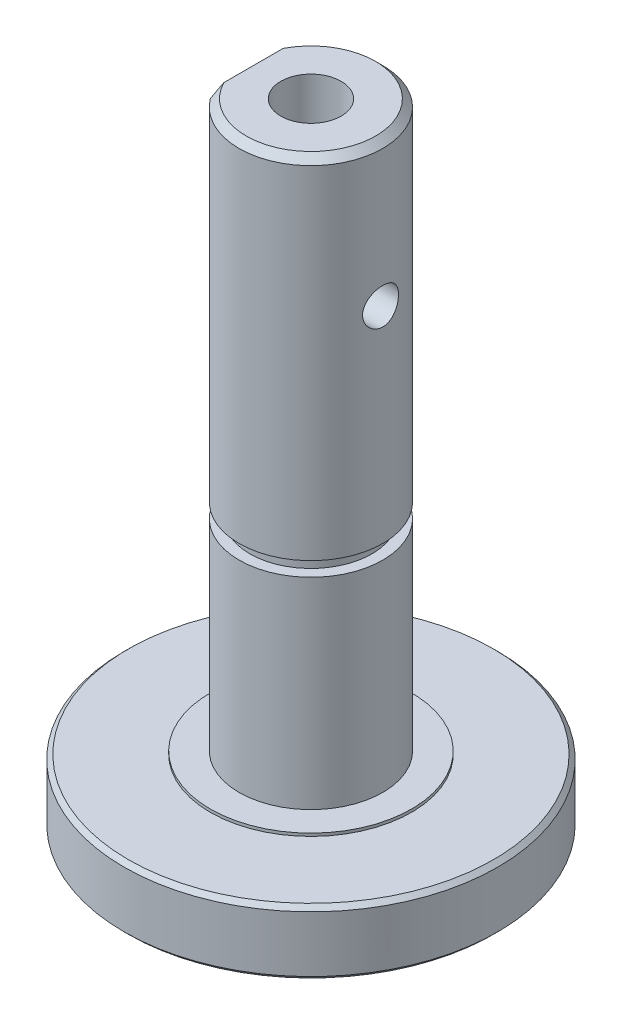
ISO-10303-21;
HEADER;
FILE_DESCRIPTION(('STEP AP214'),'2;1');
FILE_NAME('part.step','',(''),(''),'','','');
FILE_SCHEMA(('AUTOMOTIVE_DESIGN { 1 0 10303 214 1 1 1 1 }'));
ENDSEC;
DATA;
#1=APPLICATION_CONTEXT('core data for automotive mechanical design processes');
#2=APPLICATION_PROTOCOL_DEFINITION('international standard','automotive_design',2000,#1);
#3=PRODUCT_CONTEXT('',#1,'mechanical');
#4=PRODUCT('Part','Part','',(#3));
#5=PRODUCT_RELATED_PRODUCT_CATEGORY('part','',(#4));
#6=PRODUCT_DEFINITION_FORMATION('','',#4);
#7=PRODUCT_DEFINITION_CONTEXT('part definition',#1,'design');
#8=PRODUCT_DEFINITION('design','',#6,#7);
#9=PRODUCT_DEFINITION_SHAPE('','',#8);
#10=(LENGTH_UNIT() NAMED_UNIT(*) SI_UNIT(.MILLI.,.METRE.));
#11=(NAMED_UNIT(*) PLANE_ANGLE_UNIT() SI_UNIT($,.RADIAN.));
#12=(NAMED_UNIT(*) SI_UNIT($,.STERADIAN.) SOLID_ANGLE_UNIT());
#13=UNCERTAINTY_MEASURE_WITH_UNIT(LENGTH_MEASURE(1.E-05),#10,'distance_accuracy_value','');
#14=(GEOMETRIC_REPRESENTATION_CONTEXT(3) GLOBAL_UNCERTAINTY_ASSIGNED_CONTEXT((#13)) GLOBAL_UNIT_ASSIGNED_CONTEXT((#10,
#11,#12)) REPRESENTATION_CONTEXT('',''));
#15=CARTESIAN_POINT('',(0.,0.,0.));
#16=DIRECTION('',(0.,0.,1.));
#17=DIRECTION('',(1.,0.,0.));
#18=AXIS2_PLACEMENT_3D('',#15,#16,#17);
#19=CARTESIAN_POINT('',(0.,29.9999999999727,0.));
#20=DIRECTION('',(0.,1.,0.));
#21=DIRECTION('',(0.,0.,1.));
#22=AXIS2_PLACEMENT_3D('',#19,#20,#21);
#23=CONICAL_SURFACE('',#22,2.09999999992761,1.02974425863875);
#24=CARTESIAN_POINT('',(0.,28.7381927000183,0.));
#25=VERTEX_POINT('',#24);
#26=VERTEX_LOOP('',#25);
#27=FACE_BOUND('',#26,.T.);
#28=CARTESIAN_POINT('',(0.,30.,0.));
#29=DIRECTION('',(0.,1.,0.));
#30=DIRECTION('',(0.,0.,1.));
#31=AXIS2_PLACEMENT_3D('',#28,#29,#30);
#32=CIRCLE('',#31,2.09999999999999);
#33=CARTESIAN_POINT('',(0.,30.,2.09999999999999));
#34=VERTEX_POINT('',#33);
#35=EDGE_CURVE('E89',#34,#34,#32,.T.);
#36=ORIENTED_EDGE('',*,*,#35,.T.);
#37=EDGE_LOOP('',(#36));
#38=FACE_BOUND('',#37,.T.);
#39=ADVANCED_FACE('F16',(#27,#38),#23,.F.);
#40=CARTESIAN_POINT('',(-4.,34.,0.));
#41=DIRECTION('',(-1.,0.,0.));
#42=DIRECTION('',(0.,0.,1.));
#43=AXIS2_PLACEMENT_3D('',#40,#41,#42);
#44=CYLINDRICAL_SURFACE('',#43,1.24999999999999);
#45=CARTESIAN_POINT('',(-1.68745370306862,34.,1.24999999999999));
#46=CARTESIAN_POINT('',(-1.68745610640581,34.0630006655252,1.2499985309283));
#47=CARTESIAN_POINT('',(-1.6910375144996,34.1260114563411,1.24520515796918));
#48=CARTESIAN_POINT('',(-1.70474338519784,34.2499246597574,1.22636763306319));
#49=CARTESIAN_POINT('',(-1.71487580479799,34.3108244133437,1.2123122308622));
#50=CARTESIAN_POINT('',(-1.74005255159893,34.4284522290474,1.17588168193644));
#51=CARTESIAN_POINT('',(-1.75506152675973,34.4852068184474,1.15356625785283));
#52=CARTESIAN_POINT('',(-1.78823762026106,34.5941304009677,1.10143511032645));
#53=CARTESIAN_POINT('',(-1.80640570016159,34.6462979906087,1.07161710202794));
#54=CARTESIAN_POINT('',(-1.84649124284766,34.7514455644668,1.00115022776827));
#55=CARTESIAN_POINT('',(-1.86859693490956,34.803770364812,0.959630581346921));
#56=CARTESIAN_POINT('',(-1.91255564221283,34.9012559706951,0.868725291822874));
#57=CARTESIAN_POINT('',(-1.93440846308017,34.9464115659202,0.819333979649907));
#58=CARTESIAN_POINT('',(-1.97814126615291,35.0329973386529,0.707751404075617));
#59=CARTESIAN_POINT('',(-1.99977989298549,35.0735290197329,0.644758970804779));
#60=CARTESIAN_POINT('',(-2.0379782362367,35.1431104883153,0.511315990956433));
#61=CARTESIAN_POINT('',(-2.05454250560576,35.172170575465,0.440872206891049));
#62=CARTESIAN_POINT('',(-2.07932595217146,35.2150603977896,0.30154302365347));
#63=CARTESIAN_POINT('',(-2.08818464098306,35.2300676903063,0.233136790814246));
#64=CARTESIAN_POINT('',(-2.09903519762539,35.2484015892297,0.0942621280415494));
#65=CARTESIAN_POINT('',(-2.10103339121444,35.2517389560099,0.0237956582692887));
#66=CARTESIAN_POINT('',(-2.09813230663177,35.2468594070678,-0.107922099914165));
#67=CARTESIAN_POINT('',(-2.09404538266851,35.2400034520701,-0.169248065338556));
#68=CARTESIAN_POINT('',(-2.08080479518968,35.2175103337466,-0.289692009797121));
#69=CARTESIAN_POINT('',(-2.07165075831288,35.2018725233442,-0.348809825785033));
#70=CARTESIAN_POINT('',(-2.04899681367323,35.1623898164071,-0.463756346217702));
#71=CARTESIAN_POINT('',(-2.03546963256177,35.1384933479882,-0.519561736907154));
#72=CARTESIAN_POINT('',(-2.00515805145886,35.0833689520189,-0.626443464571555));
#73=CARTESIAN_POINT('',(-1.98837278114531,35.0521390650493,-0.677518532554832));
#74=CARTESIAN_POINT('',(-1.95063183484878,34.9790601269537,-0.77997231991843));
#75=CARTESIAN_POINT('',(-1.92941768288255,34.9363914778028,-0.830670674290609));
#76=CARTESIAN_POINT('',(-1.88620279016148,34.8437657020769,-0.92461859838975));
#77=CARTESIAN_POINT('',(-1.86420103318825,34.7937988827901,-0.967858092785041));
#78=CARTESIAN_POINT('',(-1.81898454674941,34.6812901775024,-1.0505988962443));
#79=CARTESIAN_POINT('',(-1.79591422588884,34.6179651542356,-1.08912374671594));
#80=CARTESIAN_POINT('',(-1.754432628485,34.4842884036896,-1.15476510422905));
#81=CARTESIAN_POINT('',(-1.73601273216002,34.4139500187967,-1.1819027807022));
#82=CARTESIAN_POINT('',(-1.7107125877551,34.2862165675972,-1.21812282599001));
#83=CARTESIAN_POINT('',(-1.70210071456545,34.2299625126262,-1.2300189880835));
#84=CARTESIAN_POINT('',(-1.6904730508573,34.1158073167195,-1.24595420207078));
#85=CARTESIAN_POINT('',(-1.68745149400791,34.0579079355976,-1.25000135031762));
#86=CARTESIAN_POINT('',(-1.68745610640581,33.9369993344748,-1.2499985309283));
#87=CARTESIAN_POINT('',(-1.6910375144996,33.8739885436589,-1.24520515796918));
#88=CARTESIAN_POINT('',(-1.70474338519785,33.7500753402425,-1.22636763306319));
#89=CARTESIAN_POINT('',(-1.71487580479799,33.6891755866563,-1.2123122308622));
#90=CARTESIAN_POINT('',(-1.74005255159893,33.5715477709525,-1.17588168193644));
#91=CARTESIAN_POINT('',(-1.75506152675973,33.5147931815526,-1.15356625785283));
#92=CARTESIAN_POINT('',(-1.78823762026106,33.4058695990322,-1.10143511032645));
#93=CARTESIAN_POINT('',(-1.8064057001616,33.3537020093912,-1.07161710202795));
#94=CARTESIAN_POINT('',(-1.84649124284766,33.2485544355332,-1.00115022776827));
#95=CARTESIAN_POINT('',(-1.86859693490957,33.196229635188,-0.95963058134692));
#96=CARTESIAN_POINT('',(-1.91255564221284,33.0987440293049,-0.868725291822871));
#97=CARTESIAN_POINT('',(-1.93440846308018,33.0535884340798,-0.819333979649906));
#98=CARTESIAN_POINT('',(-1.97814126615291,32.9670026613471,-0.707751404075615));
#99=CARTESIAN_POINT('',(-1.99977989298549,32.9264709802671,-0.644758970804775));
#100=CARTESIAN_POINT('',(-2.0379782362367,32.8568895116847,-0.511315990956426));
#101=CARTESIAN_POINT('',(-2.05454250560577,32.827829424535,-0.440872206891041));
#102=CARTESIAN_POINT('',(-2.07932595217146,32.7849396022104,-0.301543023653461));
#103=CARTESIAN_POINT('',(-2.08818464098306,32.7699323096937,-0.233136790814237));
#104=CARTESIAN_POINT('',(-2.09903519762539,32.7515984107702,-0.0942621280415395));
#105=CARTESIAN_POINT('',(-2.10103339121444,32.7482610439901,-0.0237956582692779));
#106=CARTESIAN_POINT('',(-2.09813230663177,32.7531405929322,0.107922099914177));
#107=CARTESIAN_POINT('',(-2.09404538266851,32.7599965479299,0.169248065338568));
#108=CARTESIAN_POINT('',(-2.08080479518968,32.7824896662534,0.289692009797132));
#109=CARTESIAN_POINT('',(-2.07165075831288,32.7981274766558,0.348809825785042));
#110=CARTESIAN_POINT('',(-2.04899681367323,32.8376101835929,0.463756346217712));
#111=CARTESIAN_POINT('',(-2.03546963256177,32.8615066520118,0.519561736907165));
#112=CARTESIAN_POINT('',(-2.00515805145885,32.9166310479811,0.626443464571564));
#113=CARTESIAN_POINT('',(-1.9883727811453,32.9478609349507,0.677518532554839));
#114=CARTESIAN_POINT('',(-1.95063183484878,33.0209398730463,0.779972319918435));
#115=CARTESIAN_POINT('',(-1.92941768288254,33.0636085221972,0.830670674290614));
#116=CARTESIAN_POINT('',(-1.88620279016147,33.1562342979231,0.924618598389756));
#117=CARTESIAN_POINT('',(-1.86420103318825,33.2062011172099,0.967858092785046));
#118=CARTESIAN_POINT('',(-1.8189845467494,33.3187098224976,1.0505988962443));
#119=CARTESIAN_POINT('',(-1.79591422588884,33.3820348457645,1.08912374671594));
#120=CARTESIAN_POINT('',(-1.75443262848499,33.5157115963104,1.15476510422905));
#121=CARTESIAN_POINT('',(-1.73601273216002,33.5860499812033,1.1819027807022));
#122=CARTESIAN_POINT('',(-1.71071258775509,33.7137834324028,1.21812282599));
#123=CARTESIAN_POINT('',(-1.70210071456545,33.7700374873738,1.23001898808349));
#124=CARTESIAN_POINT('',(-1.6904730508573,33.8841926832804,1.24595420207077));
#125=CARTESIAN_POINT('',(-1.68745149400791,33.9420920644024,1.25000135031761));
#126=CARTESIAN_POINT('',(-1.68745370306862,34.,1.24999999999999));
#127=B_SPLINE_CURVE_WITH_KNOTS('',3,(#45,#46,#47,#48,#49,#50,#51,#52,#53,#54,#55,#56,#57,#58,
#59,#60,#61,#62,#63,#64,#65,#66,#67,#68,#69,#70,#71,#72,#73,#74,#75,#76,#77,#78,#79,#80,#81,#82,
#83,#84,#85,#86,#87,#88,#89,#90,#91,#92,#93,#94,#95,#96,#97,#98,#99,#100,#101,#102,#103,#104,
#105,#106,#107,#108,#109,#110,#111,#112,#113,#114,#115,#116,#117,#118,#119,#120,#121,#122,#123,
#124,#125,#126),.UNSPECIFIED.,.T.,.F.,(4,2,2,2,2,2,2,2,2,2,2,2,2,2,2,2,2,2,2,2,2,2,2,2,2,2,2,2,
2,2,2,2,2,2,2,2,2,2,2,2,4),(0.,0.188755215617773,0.377740129079827,0.565384493647486,
0.753086073212704,0.963335203118905,1.17373644167763,1.40638056831623,1.63881534024358,
1.84933743265751,2.05966535978179,2.24431346785787,2.42897518321382,2.6148115167868,
2.80069756066443,3.00859753163288,3.21677616877338,3.44850854111367,3.67980817982941,
3.85348439909486,4.02698137374734,4.2157365893651,4.40472150282716,4.59236586739482,
4.78006744696003,4.99031657686624,5.20071781542496,5.43336194206356,5.66579671399091,
5.87631880640484,6.08664673352913,6.2712948416052,6.45595655696115,6.64179289053414,
6.82767893441177,7.03557890538022,7.24375754252071,7.475489914861,7.70678955357674,
7.88046577284218,8.05396274749463),.UNSPECIFIED.);
#128=CARTESIAN_POINT('',(-1.68745370306862,34.,1.24999999999999));
#129=VERTEX_POINT('',#128);
#130=EDGE_CURVE('E19',#129,#129,#127,.T.);
#131=ORIENTED_EDGE('',*,*,#130,.F.);
#132=EDGE_LOOP('',(#131));
#133=FACE_BOUND('',#132,.T.);
#134=CARTESIAN_POINT('',(-4.,34.,0.));
#135=DIRECTION('',(-1.,0.,0.));
#136=DIRECTION('',(0.,0.,1.));
#137=AXIS2_PLACEMENT_3D('',#134,#135,#136);
#138=CIRCLE('',#137,1.24999999999999);
#139=CARTESIAN_POINT('',(-4.,34.,1.24999999999999));
#140=VERTEX_POINT('',#139);
#141=EDGE_CURVE('E76',#140,#140,#138,.T.);
#142=ORIENTED_EDGE('',*,*,#141,.T.);
#143=EDGE_LOOP('',(#142));
#144=FACE_BOUND('',#143,.T.);
#145=ADVANCED_FACE('F161',(#133,#144),#44,.F.);
#146=CARTESIAN_POINT('',(0.,44.,0.));
#147=DIRECTION('',(0.,1.,0.));
#148=DIRECTION('',(0.,0.,1.));
#149=AXIS2_PLACEMENT_3D('',#146,#147,#148);
#150=CYLINDRICAL_SURFACE('',#149,2.09999999999999);
#151=ORIENTED_EDGE('',*,*,#35,.F.);
#152=EDGE_LOOP('',(#151));
#153=FACE_BOUND('',#152,.T.);
#154=CARTESIAN_POINT('',(1.68745370306862,34.,1.24999999999999));
#155=CARTESIAN_POINT('',(1.68745610640581,33.9369993344748,1.2499985309283));
#156=CARTESIAN_POINT('',(1.6910375144996,33.8739885436589,1.24520515796918));
#157=CARTESIAN_POINT('',(1.70474338519784,33.7500753402426,1.22636763306319));
#158=CARTESIAN_POINT('',(1.71487580479799,33.6891755866563,1.2123122308622));
#159=CARTESIAN_POINT('',(1.74005255159893,33.5715477709525,1.17588168193644));
#160=CARTESIAN_POINT('',(1.75506152675973,33.5147931815526,1.15356625785283));
#161=CARTESIAN_POINT('',(1.78823762026106,33.4058695990322,1.10143511032645));
#162=CARTESIAN_POINT('',(1.80640570016159,33.3537020093912,1.07161710202795));
#163=CARTESIAN_POINT('',(1.84649124284766,33.2485544355332,1.00115022776827));
#164=CARTESIAN_POINT('',(1.86859693490956,33.196229635188,0.959630581346921));
#165=CARTESIAN_POINT('',(1.91255564221283,33.0987440293049,0.868725291822876));
#166=CARTESIAN_POINT('',(1.93440846308017,33.0535884340798,0.819333979649913));
#167=CARTESIAN_POINT('',(1.97814126615291,32.9670026613471,0.707751404075624));
#168=CARTESIAN_POINT('',(1.99977989298548,32.9264709802671,0.644758970804784));
#169=CARTESIAN_POINT('',(2.0379782362367,32.8568895116847,0.511315990956433));
#170=CARTESIAN_POINT('',(2.05454250560576,32.827829424535,0.440872206891046));
#171=CARTESIAN_POINT('',(2.07932595217146,32.7849396022104,0.301543023653464));
#172=CARTESIAN_POINT('',(2.08818464098306,32.7699323096937,0.233136790814241));
#173=CARTESIAN_POINT('',(2.09903519762539,32.7515984107702,0.0942621280415454));
#174=CARTESIAN_POINT('',(2.10103339121444,32.7482610439901,0.0237956582692849));
#175=CARTESIAN_POINT('',(2.09813230663177,32.7531405929322,-0.10792209991417));
#176=CARTESIAN_POINT('',(2.09404538266851,32.7599965479299,-0.169248065338561));
#177=CARTESIAN_POINT('',(2.08080479518968,32.7824896662534,-0.289692009797126));
#178=CARTESIAN_POINT('',(2.07165075831288,32.7981274766558,-0.348809825785036));
#179=CARTESIAN_POINT('',(2.04899681367323,32.8376101835929,-0.463756346217707));
#180=CARTESIAN_POINT('',(2.03546963256177,32.8615066520118,-0.51956173690716));
#181=CARTESIAN_POINT('',(2.00515805145886,32.9166310479811,-0.626443464571561));
#182=CARTESIAN_POINT('',(1.98837278114531,32.9478609349507,-0.677518532554836));
#183=CARTESIAN_POINT('',(1.95063183484878,33.0209398730463,-0.779972319918432));
#184=CARTESIAN_POINT('',(1.92941768288255,33.0636085221972,-0.83067067429061));
#185=CARTESIAN_POINT('',(1.88620279016148,33.1562342979231,-0.924618598389751));
#186=CARTESIAN_POINT('',(1.86420103318825,33.2062011172099,-0.967858092785043));
#187=CARTESIAN_POINT('',(1.8189845467494,33.3187098224976,-1.0505988962443));
#188=CARTESIAN_POINT('',(1.79591422588884,33.3820348457644,-1.08912374671594));
#189=CARTESIAN_POINT('',(1.754432628485,33.5157115963104,-1.15476510422905));
#190=CARTESIAN_POINT('',(1.73601273216002,33.5860499812033,-1.1819027807022));
#191=CARTESIAN_POINT('',(1.7107125877551,33.7137834324028,-1.21812282599001));
#192=CARTESIAN_POINT('',(1.70210071456545,33.7700374873738,-1.2300189880835));
#193=CARTESIAN_POINT('',(1.6904730508573,33.8841926832804,-1.24595420207078));
#194=CARTESIAN_POINT('',(1.68745149400791,33.9420920644024,-1.25000135031762));
#195=CARTESIAN_POINT('',(1.68745610640581,34.0630006655252,-1.2499985309283));
#196=CARTESIAN_POINT('',(1.6910375144996,34.1260114563411,-1.24520515796918));
#197=CARTESIAN_POINT('',(1.70474338519785,34.2499246597574,-1.22636763306319));
#198=CARTESIAN_POINT('',(1.71487580479799,34.3108244133437,-1.2123122308622));
#199=CARTESIAN_POINT('',(1.74005255159893,34.4284522290475,-1.17588168193644));
#200=CARTESIAN_POINT('',(1.75506152675973,34.4852068184474,-1.15356625785283));
#201=CARTESIAN_POINT('',(1.78823762026106,34.5941304009678,-1.10143511032645));
#202=CARTESIAN_POINT('',(1.8064057001616,34.6462979906088,-1.07161710202795));
#203=CARTESIAN_POINT('',(1.84649124284766,34.7514455644668,-1.00115022776827));
#204=CARTESIAN_POINT('',(1.86859693490957,34.803770364812,-0.95963058134692));
#205=CARTESIAN_POINT('',(1.91255564221284,34.9012559706951,-0.868725291822871));
#206=CARTESIAN_POINT('',(1.93440846308018,34.9464115659202,-0.819333979649906));
#207=CARTESIAN_POINT('',(1.97814126615291,35.0329973386529,-0.707751404075616));
#208=CARTESIAN_POINT('',(1.99977989298549,35.0735290197329,-0.644758970804778));
#209=CARTESIAN_POINT('',(2.0379782362367,35.1431104883153,-0.511315990956428));
#210=CARTESIAN_POINT('',(2.05454250560577,35.172170575465,-0.44087220689104));
#211=CARTESIAN_POINT('',(2.07932595217146,35.2150603977896,-0.301543023653458));
#212=CARTESIAN_POINT('',(2.08818464098306,35.2300676903063,-0.233136790814234));
#213=CARTESIAN_POINT('',(2.09903519762539,35.2484015892298,-0.0942621280415378));
#214=CARTESIAN_POINT('',(2.10103339121444,35.2517389560099,-0.0237956582692767));
#215=CARTESIAN_POINT('',(2.09813230663177,35.2468594070677,0.107922099914178));
#216=CARTESIAN_POINT('',(2.09404538266851,35.2400034520701,0.169248065338568));
#217=CARTESIAN_POINT('',(2.08080479518968,35.2175103337466,0.289692009797132));
#218=CARTESIAN_POINT('',(2.07165075831288,35.2018725233442,0.348809825785042));
#219=CARTESIAN_POINT('',(2.04899681367323,35.1623898164071,0.463756346217712));
#220=CARTESIAN_POINT('',(2.03546963256177,35.1384933479882,0.519561736907165));
#221=CARTESIAN_POINT('',(2.00515805145885,35.0833689520189,0.626443464571564));
#222=CARTESIAN_POINT('',(1.9883727811453,35.0521390650493,0.677518532554839));
#223=CARTESIAN_POINT('',(1.95063183484878,34.9790601269537,0.779972319918435));
#224=CARTESIAN_POINT('',(1.92941768288254,34.9363914778028,0.830670674290614));
#225=CARTESIAN_POINT('',(1.88620279016147,34.8437657020769,0.924618598389756));
#226=CARTESIAN_POINT('',(1.86420103318825,34.7937988827901,0.967858092785046));
#227=CARTESIAN_POINT('',(1.8189845467494,34.6812901775024,1.0505988962443));
#228=CARTESIAN_POINT('',(1.79591422588884,34.6179651542355,1.08912374671594));
#229=CARTESIAN_POINT('',(1.75443262848499,34.4842884036896,1.15476510422905));
#230=CARTESIAN_POINT('',(1.73601273216002,34.4139500187967,1.1819027807022));
#231=CARTESIAN_POINT('',(1.71071258775509,34.2862165675972,1.21812282599));
#232=CARTESIAN_POINT('',(1.70210071456545,34.2299625126262,1.23001898808349));
#233=CARTESIAN_POINT('',(1.6904730508573,34.1158073167196,1.24595420207077));
#234=CARTESIAN_POINT('',(1.68745149400791,34.0579079355976,1.25000135031761));
#235=CARTESIAN_POINT('',(1.68745370306862,34.,1.24999999999999));
#236=B_SPLINE_CURVE_WITH_KNOTS('',3,(#154,#155,#156,#157,#158,#159,#160,#161,#162,#163,#164,
#165,#166,#167,#168,#169,#170,#171,#172,#173,#174,#175,#176,#177,#178,#179,#180,#181,#182,#183,
#184,#185,#186,#187,#188,#189,#190,#191,#192,#193,#194,#195,#196,#197,#198,#199,#200,#201,#202,
#203,#204,#205,#206,#207,#208,#209,#210,#211,#212,#213,#214,#215,#216,#217,#218,#219,#220,#221,
#222,#223,#224,#225,#226,#227,#228,#229,#230,#231,#232,#233,#234,#235),.UNSPECIFIED.,.T.,.F.,(4,
2,2,2,2,2,2,2,2,2,2,2,2,2,2,2,2,2,2,2,2,2,2,2,2,2,2,2,2,2,2,2,2,2,2,2,2,2,2,2,4),(0.,
0.188755215617773,0.377740129079827,0.565384493647486,0.753086073212704,0.963335203118899,
1.17373644167762,1.40638056831623,1.63881534024358,1.84933743265751,2.05966535978179,
2.24431346785787,2.42897518321382,2.61481151678681,2.80069756066443,3.00859753163288,
3.21677616877338,3.44850854111366,3.67980817982941,3.85348439909486,4.02698137374733,
4.2157365893651,4.40472150282716,4.59236586739482,4.78006744696003,4.99031657686623,
5.20071781542495,5.43336194206355,5.66579671399091,5.87631880640484,6.08664673352912,
6.2712948416052,6.45595655696114,6.64179289053414,6.82767893441176,7.03557890538021,
7.24375754252071,7.47548991486099,7.70678955357674,7.88046577284217,8.05396274749463),.UNSPECIFIED.);
#237=CARTESIAN_POINT('',(1.68745370306862,34.,1.24999999999999));
#238=VERTEX_POINT('',#237);
#239=EDGE_CURVE('E71',#238,#238,#236,.T.);
#240=ORIENTED_EDGE('',*,*,#239,.T.);
#241=EDGE_LOOP('',(#240));
#242=FACE_BOUND('',#241,.T.);
#243=CARTESIAN_POINT('',(0.,44.,0.));
#244=DIRECTION('',(0.,1.,0.));
#245=DIRECTION('',(0.,0.,1.));
#246=AXIS2_PLACEMENT_3D('',#243,#244,#245);
#247=CIRCLE('',#246,2.09999999999999);
#248=CARTESIAN_POINT('',(0.,44.,2.09999999999999));
#249=VERTEX_POINT('',#248);
#250=EDGE_CURVE('E91',#249,#249,#247,.T.);
#251=ORIENTED_EDGE('',*,*,#250,.T.);
#252=EDGE_LOOP('',(#251));
#253=FACE_BOUND('',#252,.T.);
#254=ORIENTED_EDGE('',*,*,#130,.T.);
#255=EDGE_LOOP('',(#254));
#256=FACE_BOUND('',#255,.T.);
#257=ADVANCED_FACE('F158',(#153,#242,#253,#256),#150,.F.);
#258=CARTESIAN_POINT('',(0.,44.,-5.00000000000001));
#259=DIRECTION('',(0.,-1.,0.));
#260=DIRECTION('',(0.,0.,-1.));
#261=AXIS2_PLACEMENT_3D('',#258,#259,#260);
#262=PLANE('',#261);
#263=DIRECTION('',(0.,0.,-1.));
#264=VECTOR('',#263,1.);
#265=CARTESIAN_POINT('',(-4.,44.,-3.00000000000001));
#266=LINE('',#265,#264);
#267=CARTESIAN_POINT('',(-4.,44.0000000000205,-2.06155281286636));
#268=VERTEX_POINT('',#267);
#269=CARTESIAN_POINT('',(-4.,44.0000000000397,2.06155281282439));
#270=VERTEX_POINT('',#269);
#271=EDGE_CURVE('E75',#268,#270,#266,.F.);
#272=ORIENTED_EDGE('',*,*,#271,.T.);
#273=CARTESIAN_POINT('',(0.,44.0000000000396,0.));
#274=DIRECTION('',(0.,-1.,0.));
#275=DIRECTION('',(0.,0.,-1.));
#276=AXIS2_PLACEMENT_3D('',#273,#274,#275);
#277=CIRCLE('',#276,4.50000000000727);
#278=EDGE_CURVE('E61',#268,#270,#277,.T.);
#279=ORIENTED_EDGE('',*,*,#278,.F.);
#280=EDGE_LOOP('',(#272,#279));
#281=FACE_BOUND('',#280,.T.);
#282=ORIENTED_EDGE('',*,*,#250,.F.);
#283=EDGE_LOOP('',(#282));
#284=FACE_BOUND('',#283,.T.);
#285=ADVANCED_FACE('F78',(#281,#284),#262,.F.);
#286=CARTESIAN_POINT('',(0.,24.,0.));
#287=DIRECTION('',(0.,1.,0.));
#288=DIRECTION('',(0.,0.,1.));
#289=AXIS2_PLACEMENT_3D('',#286,#287,#288);
#290=PLANE('',#289);
#291=CARTESIAN_POINT('',(0.,24.,0.));
#292=DIRECTION('',(0.,1.,0.));
#293=DIRECTION('',(0.,0.,1.));
#294=AXIS2_PLACEMENT_3D('',#291,#292,#293);
#295=CIRCLE('',#294,5.);
#296=CARTESIAN_POINT('',(-4.,24.,3.));
#297=VERTEX_POINT('',#296);
#298=CARTESIAN_POINT('',(-4.,24.,-3.00000000000001));
#299=VERTEX_POINT('',#298);
#300=EDGE_CURVE('E88',#297,#299,#295,.F.);
#301=ORIENTED_EDGE('',*,*,#300,.F.);
#302=DIRECTION('',(0.,0.,-1.));
#303=VECTOR('',#302,1.);
#304=CARTESIAN_POINT('',(-4.,24.,-3.00000000000001));
#305=LINE('',#304,#303);
#306=EDGE_CURVE('E55',#297,#299,#305,.T.);
#307=ORIENTED_EDGE('',*,*,#306,.T.);
#308=EDGE_LOOP('',(#301,#307));
#309=FACE_BOUND('',#308,.T.);
#310=ADVANCED_FACE('F152',(#309),#290,.T.);
#311=CARTESIAN_POINT('',(-4.,24.,-3.00000000000001));
#312=DIRECTION('',(1.,0.,0.));
#313=DIRECTION('',(0.,0.,-1.));
#314=AXIS2_PLACEMENT_3D('',#311,#312,#313);
#315=PLANE('',#314);
#316=CARTESIAN_POINT('',(-4.,43.5000000000344,-3.00000000002078));
#317=CARTESIAN_POINT('',(-4.,43.5456208465103,-2.92395437789639));
#318=CARTESIAN_POINT('',(-4.,43.5904380706184,-2.84741921079845));
#319=CARTESIAN_POINT('',(-4.,43.6781671324268,-2.69334289147431));
#320=CARTESIAN_POINT('',(-4.,43.7210803938501,-2.6158025489295));
#321=CARTESIAN_POINT('',(-4.,43.8047789265617,-2.45956360717905));
#322=CARTESIAN_POINT('',(-4.,43.8455639268892,-2.38086486211799));
#323=CARTESIAN_POINT('',(-4.,43.9247002515941,-2.2221801424986));
#324=CARTESIAN_POINT('',(-4.,43.9630496980147,-2.14219323285428));
#325=CARTESIAN_POINT('',(-4.,44.000000000041,-2.06155281282164));
#326=B_SPLINE_CURVE_WITH_KNOTS('',3,(#316,#317,#318,#319,#320,#321,#322,#323,#324,#325),
.UNSPECIFIED.,.F.,.F.,(4,2,2,2,4),(0.,0.266045107238104,0.5318878006999,0.797764257926815,
1.06384329321034),.UNSPECIFIED.);
#327=CARTESIAN_POINT('',(-4.,43.5000000000234,-3.00000000000001));
#328=VERTEX_POINT('',#327);
#329=EDGE_CURVE('E66',#328,#268,#326,.T.);
#330=ORIENTED_EDGE('',*,*,#329,.F.);
#331=DIRECTION('',(0.,1.,0.));
#332=VECTOR('',#331,1.);
#333=CARTESIAN_POINT('',(-4.,44.,-3.00000000000001));
#334=LINE('',#333,#332);
#335=EDGE_CURVE('E84',#299,#328,#334,.T.);
#336=ORIENTED_EDGE('',*,*,#335,.F.);
#337=ORIENTED_EDGE('',*,*,#306,.F.);
#338=DIRECTION('',(0.,1.,0.));
#339=VECTOR('',#338,1.);
#340=CARTESIAN_POINT('',(-4.,44.,3.));
#341=LINE('',#340,#339);
#342=CARTESIAN_POINT('',(-4.,43.5000000000172,3.00000000001034));
#343=VERTEX_POINT('',#342);
#344=EDGE_CURVE('E70',#343,#297,#341,.F.);
#345=ORIENTED_EDGE('',*,*,#344,.F.);
#346=CARTESIAN_POINT('',(-4.,44.0000000000398,2.06155281282407));
#347=CARTESIAN_POINT('',(-4.,43.9630496980137,2.14219323285649));
#348=CARTESIAN_POINT('',(-4.,43.9247002515931,2.22218014250058));
#349=CARTESIAN_POINT('',(-4.,43.8455639268884,2.38086486211954));
#350=CARTESIAN_POINT('',(-4.,43.804778926561,2.45956360718039));
#351=CARTESIAN_POINT('',(-4.,43.7210803938496,2.61580254893042));
#352=CARTESIAN_POINT('',(-4.,43.6781671324264,2.69334289147501));
#353=CARTESIAN_POINT('',(-4.,43.5904380706182,2.84741921079875));
#354=CARTESIAN_POINT('',(-4.,43.5456208465102,2.92395437789648));
#355=CARTESIAN_POINT('',(-4.,43.5000000000344,3.00000000002067));
#356=B_SPLINE_CURVE_WITH_KNOTS('',3,(#346,#347,#348,#349,#350,#351,#352,#353,#354,#355),
.UNSPECIFIED.,.F.,.F.,(4,2,2,2,4),(0.,0.266079035282831,0.531955492509049,0.797798185970145,
1.06384329320755),.UNSPECIFIED.);
#357=EDGE_CURVE('E64',#270,#343,#356,.T.);
#358=ORIENTED_EDGE('',*,*,#357,.F.);
#359=ORIENTED_EDGE('',*,*,#271,.F.);
#360=EDGE_LOOP('',(#330,#336,#337,#345,#358,#359));
#361=FACE_BOUND('',#360,.T.);
#362=ORIENTED_EDGE('',*,*,#141,.F.);
#363=EDGE_LOOP('',(#362));
#364=FACE_BOUND('',#363,.T.);
#365=ADVANCED_FACE('F73',(#361,#364),#315,.F.);
#366=CARTESIAN_POINT('',(-4.,34.,0.));
#367=DIRECTION('',(-1.,0.,0.));
#368=DIRECTION('',(0.,0.,1.));
#369=AXIS2_PLACEMENT_3D('',#366,#367,#368);
#370=CYLINDRICAL_SURFACE('',#369,1.24999999999999);
#371=ORIENTED_EDGE('',*,*,#239,.F.);
#372=EDGE_LOOP('',(#371));
#373=FACE_BOUND('',#372,.T.);
#374=CARTESIAN_POINT('',(4.84122918275928,34.,-1.24999999999999));
#375=CARTESIAN_POINT('',(4.8412314741452,33.9310545701956,-1.24999644400797));
#376=CARTESIAN_POINT('',(4.84271979121747,33.8620277808896,-1.24427030525185));
#377=CARTESIAN_POINT('',(4.84850341979491,33.7258952876943,-1.22153436081048));
#378=CARTESIAN_POINT('',(4.85280404967583,33.6587934756188,-1.2045031751854));
#379=CARTESIAN_POINT('',(4.86369448351863,33.5285911452637,-1.15974221582674));
#380=CARTESIAN_POINT('',(4.87028015753347,33.4654836494071,-1.13203173372172));
#381=CARTESIAN_POINT('',(4.88499331215876,33.3448271202531,-1.06674964109634));
#382=CARTESIAN_POINT('',(4.89312040926769,33.2872767097326,-1.02918048249563));
#383=CARTESIAN_POINT('',(4.91020334997785,33.178070876427,-0.944355382269925));
#384=CARTESIAN_POINT('',(4.91917249883275,33.1265560672526,-0.896921038603635));
#385=CARTESIAN_POINT('',(4.93681390225507,33.0321215986877,-0.794094059593248));
#386=CARTESIAN_POINT('',(4.94548611270609,32.989203211921,-0.738700248002348));
#387=CARTESIAN_POINT('',(4.96170210985922,32.9126121290031,-0.620572368228055));
#388=CARTESIAN_POINT('',(4.96922849528942,32.8790765498412,-0.557746801141879));
#389=CARTESIAN_POINT('',(4.9821541013638,32.823095000814,-0.427131068445275));
#390=CARTESIAN_POINT('',(4.98755365221139,32.8006473093523,-0.359341675437211));
#391=CARTESIAN_POINT('',(4.9955237917476,32.7679260938211,-0.222179422313684));
#392=CARTESIAN_POINT('',(4.9981494659496,32.7574151909252,-0.152866447159988));
#393=CARTESIAN_POINT('',(5.00046797088977,32.748120808973,-0.0134144977383919));
#394=CARTESIAN_POINT('',(5.00016123156442,32.74933561075,0.0567243539374062));
#395=CARTESIAN_POINT('',(4.99669048029744,32.7632874017233,0.194190090457712));
#396=CARTESIAN_POINT('',(4.99359003166422,32.775768077547,0.26154483576441));
#397=CARTESIAN_POINT('',(4.9849542183318,32.8114854897627,0.393172394532961));
#398=CARTESIAN_POINT('',(4.97941870837761,32.8347228678122,0.457445023888376));
#399=CARTESIAN_POINT('',(4.96643733104087,32.8915022176794,0.581760457393479));
#400=CARTESIAN_POINT('',(4.95897459970956,32.9251356989612,0.641759632347085));
#401=CARTESIAN_POINT('',(4.94294894831906,33.0016807711932,0.755348112922621));
#402=CARTESIAN_POINT('',(4.93438591000004,33.044593359791,0.808936728347209));
#403=CARTESIAN_POINT('',(4.91682033744527,33.1398445111069,0.909707366106707));
#404=CARTESIAN_POINT('',(4.90781217695872,33.1924055432655,0.95667832249204));
#405=CARTESIAN_POINT('',(4.89057851082835,33.3047770813393,1.04120554199562));
#406=CARTESIAN_POINT('',(4.88235335460058,33.364590796948,1.07875761403816));
#407=CARTESIAN_POINT('',(4.86759539680001,33.4902014701538,1.14351586805483));
#408=CARTESIAN_POINT('',(4.86107234105443,33.5560300900052,1.170662870853));
#409=CARTESIAN_POINT('',(4.8505857164022,33.6914392957306,1.21338782891495));
#410=CARTESIAN_POINT('',(4.84661675946645,33.7610116455321,1.22899014889385));
#411=CARTESIAN_POINT('',(4.84319198660267,33.8592989762181,1.24237742143878));
#412=CARTESIAN_POINT('',(4.84245789444077,33.8873539232981,1.24523310503275));
#413=CARTESIAN_POINT('',(4.84147602297603,33.9436013742448,1.24904512495105));
#414=CARTESIAN_POINT('',(4.84122824533514,33.9717938785814,1.25000145478449));
#415=CARTESIAN_POINT('',(4.8412314741452,34.0689454298044,1.24999644400796));
#416=CARTESIAN_POINT('',(4.84271979121748,34.1379722191104,1.24427030525184));
#417=CARTESIAN_POINT('',(4.84850341979491,34.2741047123056,1.22153436081048));
#418=CARTESIAN_POINT('',(4.85280404967583,34.3412065243812,1.2045031751854));
#419=CARTESIAN_POINT('',(4.86369448351863,34.4714088547363,1.15974221582673));
#420=CARTESIAN_POINT('',(4.87028015753347,34.5345163505929,1.13203173372171));
#421=CARTESIAN_POINT('',(4.88499331215876,34.6551728797469,1.06674964109633));
#422=CARTESIAN_POINT('',(4.89312040926769,34.7127232902674,1.02918048249562));
#423=CARTESIAN_POINT('',(4.91020334997785,34.821929123573,0.944355382269917));
#424=CARTESIAN_POINT('',(4.91917249883275,34.8734439327474,0.896921038603627));
#425=CARTESIAN_POINT('',(4.93681390225507,34.9678784013123,0.794094059593241));
#426=CARTESIAN_POINT('',(4.94548611270609,35.010796788079,0.738700248002341));
#427=CARTESIAN_POINT('',(4.96170210985922,35.0873878709969,0.620572368228048));
#428=CARTESIAN_POINT('',(4.96922849528942,35.1209234501588,0.557746801141871));
#429=CARTESIAN_POINT('',(4.9821541013638,35.176904999186,0.427131068445268));
#430=CARTESIAN_POINT('',(4.98755365221139,35.1993526906477,0.359341675437203));
#431=CARTESIAN_POINT('',(4.9955237917476,35.2320739061789,0.222179422313676));
#432=CARTESIAN_POINT('',(4.9981494659496,35.2425848090748,0.152866447159981));
#433=CARTESIAN_POINT('',(5.00046797088977,35.251879191027,0.0134144977383847));
#434=CARTESIAN_POINT('',(5.00016123156442,35.25066438925,-0.0567243539374133));
#435=CARTESIAN_POINT('',(4.99669048029744,35.2367125982767,-0.194190090457719));
#436=CARTESIAN_POINT('',(4.99359003166422,35.224231922453,-0.261544835764417));
#437=CARTESIAN_POINT('',(4.9849542183318,35.1885145102373,-0.393172394532969));
#438=CARTESIAN_POINT('',(4.97941870837761,35.1652771321878,-0.457445023888383));
#439=CARTESIAN_POINT('',(4.96643733104087,35.1084977823206,-0.581760457393486));
#440=CARTESIAN_POINT('',(4.95897459970956,35.0748643010387,-0.641759632347092));
#441=CARTESIAN_POINT('',(4.94294894831906,34.9983192288068,-0.755348112922629));
#442=CARTESIAN_POINT('',(4.93438591000004,34.955406640209,-0.808936728347216));
#443=CARTESIAN_POINT('',(4.91682033744527,34.8601554888931,-0.909707366106715));
#444=CARTESIAN_POINT('',(4.90781217695872,34.8075944567345,-0.956678322492048));
#445=CARTESIAN_POINT('',(4.89057851082835,34.6952229186607,-1.04120554199563));
#446=CARTESIAN_POINT('',(4.88235335460058,34.635409203052,-1.07875761403816));
#447=CARTESIAN_POINT('',(4.86759539680001,34.5097985298461,-1.14351586805484));
#448=CARTESIAN_POINT('',(4.86107234105443,34.4439699099947,-1.17066287085301));
#449=CARTESIAN_POINT('',(4.8505857164022,34.3085607042693,-1.21338782891496));
#450=CARTESIAN_POINT('',(4.84661675946645,34.2389883544679,-1.22899014889386));
#451=CARTESIAN_POINT('',(4.84319198660267,34.1407010237819,-1.24237742143879));
#452=CARTESIAN_POINT('',(4.84245789444077,34.1126460767019,-1.24523310503276));
#453=CARTESIAN_POINT('',(4.84147602297603,34.0563986257552,-1.24904512495106));
#454=CARTESIAN_POINT('',(4.84122824533514,34.0282061214186,-1.2500014547845));
#455=CARTESIAN_POINT('',(4.84122918275928,34.,-1.24999999999999));
#456=B_SPLINE_CURVE_WITH_KNOTS('',3,(#374,#375,#376,#377,#378,#379,#380,#381,#382,#383,#384,
#385,#386,#387,#388,#389,#390,#391,#392,#393,#394,#395,#396,#397,#398,#399,#400,#401,#402,#403,
#404,#405,#406,#407,#408,#409,#410,#411,#412,#413,#414,#415,#416,#417,#418,#419,#420,#421,#422,
#423,#424,#425,#426,#427,#428,#429,#430,#431,#432,#433,#434,#435,#436,#437,#438,#439,#440,#441,
#442,#443,#444,#445,#446,#447,#448,#449,#450,#451,#452,#453,#454,#455),.UNSPECIFIED.,.T.,.F.,(4,
2,2,2,2,2,2,2,2,2,2,2,2,2,2,2,2,2,2,2,2,2,2,2,2,2,2,2,2,2,2,2,2,2,2,2,2,2,2,2,4),(0.,
0.206727898554972,0.41384787604158,0.620595442017304,0.827291637126066,1.03811403021933,
1.24896761066022,1.46275830927948,1.6765158025581,1.88594362702333,2.09534074665038,
2.30009065917135,2.50485278698253,2.71147124581091,2.91811193037557,3.13031016686501,
3.34260265734453,3.55608525870572,3.76911601607128,3.85368974774542,3.93826376844276,
4.14499166699773,4.35211164448433,4.55885921046006,4.76555540556882,4.97637779866208,
5.18723137910298,5.40102207772224,5.61477957100085,5.82420739546609,6.03360451509313,
6.23835442761411,6.44311655542529,6.64973501425367,6.85637569881833,7.06857393530777,
7.28086642578729,7.49434902714849,7.70737978451403,7.79195351618817,7.87652753688551),.UNSPECIFIED.);
#457=CARTESIAN_POINT('',(4.84122918275928,34.,-1.24999999999999));
#458=VERTEX_POINT('',#457);
#459=EDGE_CURVE('E118',#458,#458,#456,.T.);
#460=ORIENTED_EDGE('',*,*,#459,.F.);
#461=EDGE_LOOP('',(#460));
#462=FACE_BOUND('',#461,.T.);
#463=ADVANCED_FACE('F126',(#373,#462),#370,.F.);
#464=CARTESIAN_POINT('',(0.,43.4999999999377,0.));
#465=DIRECTION('',(0.,-1.,0.));
#466=DIRECTION('',(0.,0.,-1.));
#467=AXIS2_PLACEMENT_3D('',#464,#465,#466);
#468=CONICAL_SURFACE('',#467,5.00000000010913,0.785398163397448);
#469=CARTESIAN_POINT('',(0.,43.5,0.));
#470=DIRECTION('',(0.,1.,0.));
#471=DIRECTION('',(0.,0.,1.));
#472=AXIS2_PLACEMENT_3D('',#469,#470,#471);
#473=CIRCLE('',#472,5.);
#474=EDGE_CURVE('E38',#328,#343,#473,.F.);
#475=ORIENTED_EDGE('',*,*,#474,.F.);
#476=ORIENTED_EDGE('',*,*,#329,.T.);
#477=ORIENTED_EDGE('',*,*,#278,.T.);
#478=ORIENTED_EDGE('',*,*,#357,.T.);
#479=EDGE_LOOP('',(#475,#476,#477,#478));
#480=FACE_BOUND('',#479,.T.);
#481=ADVANCED_FACE('F63',(#480),#468,.T.);
#482=CARTESIAN_POINT('',(0.,44.,0.));
#483=DIRECTION('',(0.,1.,0.));
#484=DIRECTION('',(0.,0.,1.));
#485=AXIS2_PLACEMENT_3D('',#482,#483,#484);
#486=CYLINDRICAL_SURFACE('',#485,5.);
#487=ORIENTED_EDGE('',*,*,#335,.T.);
#488=ORIENTED_EDGE('',*,*,#474,.T.);
#489=ORIENTED_EDGE('',*,*,#344,.T.);
#490=ORIENTED_EDGE('',*,*,#300,.T.);
#491=EDGE_LOOP('',(#487,#488,#489,#490));
#492=FACE_BOUND('',#491,.T.);
#493=CARTESIAN_POINT('',(0.,19.7,0.));
#494=DIRECTION('',(0.,1.,0.));
#495=DIRECTION('',(0.,0.,1.));
#496=AXIS2_PLACEMENT_3D('',#493,#494,#495);
#497=CIRCLE('',#496,5.);
#498=CARTESIAN_POINT('',(0.,19.7,5.));
#499=VERTEX_POINT('',#498);
#500=EDGE_CURVE('E115',#499,#499,#497,.T.);
#501=ORIENTED_EDGE('',*,*,#500,.T.);
#502=EDGE_LOOP('',(#501));
#503=FACE_BOUND('',#502,.T.);
#504=ORIENTED_EDGE('',*,*,#459,.T.);
#505=EDGE_LOOP('',(#504));
#506=FACE_BOUND('',#505,.T.);
#507=ADVANCED_FACE('F130',(#492,#503,#506),#486,.T.);
#508=CARTESIAN_POINT('',(0.,19.7,-4.25));
#509=DIRECTION('',(0.,1.,0.));
#510=DIRECTION('',(0.,0.,1.));
#511=AXIS2_PLACEMENT_3D('',#508,#509,#510);
#512=PLANE('',#511);
#513=CARTESIAN_POINT('',(0.,19.7,0.));
#514=DIRECTION('',(0.,1.,0.));
#515=DIRECTION('',(0.,0.,1.));
#516=AXIS2_PLACEMENT_3D('',#513,#514,#515);
#517=CIRCLE('',#516,4.25);
#518=CARTESIAN_POINT('',(0.,19.7,4.25));
#519=VERTEX_POINT('',#518);
#520=EDGE_CURVE('E112',#519,#519,#517,.F.);
#521=ORIENTED_EDGE('',*,*,#520,.F.);
#522=EDGE_LOOP('',(#521));
#523=FACE_BOUND('',#522,.T.);
#524=ORIENTED_EDGE('',*,*,#500,.F.);
#525=EDGE_LOOP('',(#524));
#526=FACE_BOUND('',#525,.T.);
#527=ADVANCED_FACE('F134',(#523,#526),#512,.F.);
#528=CARTESIAN_POINT('',(0.,44.,0.));
#529=DIRECTION('',(0.,1.,0.));
#530=DIRECTION('',(0.,0.,1.));
#531=AXIS2_PLACEMENT_3D('',#528,#529,#530);
#532=CYLINDRICAL_SURFACE('',#531,4.25);
#533=ORIENTED_EDGE('',*,*,#520,.T.);
#534=EDGE_LOOP('',(#533));
#535=FACE_BOUND('',#534,.T.);
#536=CARTESIAN_POINT('',(0.,18.7,0.));
#537=DIRECTION('',(0.,1.,0.));
#538=DIRECTION('',(0.,0.,1.));
#539=AXIS2_PLACEMENT_3D('',#536,#537,#538);
#540=CIRCLE('',#539,4.25);
#541=CARTESIAN_POINT('',(0.,18.7,4.25));
#542=VERTEX_POINT('',#541);
#543=EDGE_CURVE('E109',#542,#542,#540,.T.);
#544=ORIENTED_EDGE('',*,*,#543,.T.);
#545=EDGE_LOOP('',(#544));
#546=FACE_BOUND('',#545,.T.);
#547=ADVANCED_FACE('F218',(#535,#546),#532,.T.);
#548=CARTESIAN_POINT('',(0.,18.7,-5.));
#549=DIRECTION('',(0.,-1.,0.));
#550=DIRECTION('',(0.,0.,-1.));
#551=AXIS2_PLACEMENT_3D('',#548,#549,#550);
#552=PLANE('',#551);
#553=CARTESIAN_POINT('',(0.,18.7,0.));
#554=DIRECTION('',(0.,1.,0.));
#555=DIRECTION('',(0.,0.,1.));
#556=AXIS2_PLACEMENT_3D('',#553,#554,#555);
#557=CIRCLE('',#556,5.);
#558=CARTESIAN_POINT('',(0.,18.7,5.));
#559=VERTEX_POINT('',#558);
#560=EDGE_CURVE('E106',#559,#559,#557,.F.);
#561=ORIENTED_EDGE('',*,*,#560,.F.);
#562=EDGE_LOOP('',(#561));
#563=FACE_BOUND('',#562,.T.);
#564=ORIENTED_EDGE('',*,*,#543,.F.);
#565=EDGE_LOOP('',(#564));
#566=FACE_BOUND('',#565,.T.);
#567=ADVANCED_FACE('F215',(#563,#566),#552,.F.);
#568=CARTESIAN_POINT('',(0.,44.,0.));
#569=DIRECTION('',(0.,1.,0.));
#570=DIRECTION('',(0.,0.,1.));
#571=AXIS2_PLACEMENT_3D('',#568,#569,#570);
#572=CYLINDRICAL_SURFACE('',#571,5.);
#573=ORIENTED_EDGE('',*,*,#560,.T.);
#574=EDGE_LOOP('',(#573));
#575=FACE_BOUND('',#574,.T.);
#576=CARTESIAN_POINT('',(0.,4.7,0.));
#577=DIRECTION('',(0.,1.,0.));
#578=DIRECTION('',(0.,0.,1.));
#579=AXIS2_PLACEMENT_3D('',#576,#577,#578);
#580=CIRCLE('',#579,5.);
#581=CARTESIAN_POINT('',(0.,4.7,5.));
#582=VERTEX_POINT('',#581);
#583=EDGE_CURVE('E103',#582,#582,#580,.T.);
#584=ORIENTED_EDGE('',*,*,#583,.T.);
#585=EDGE_LOOP('',(#584));
#586=FACE_BOUND('',#585,.T.);
#587=ADVANCED_FACE('F211',(#575,#586),#572,.T.);
#588=CARTESIAN_POINT('',(0.,4.7,-7.00000000000001));
#589=DIRECTION('',(0.,-1.,0.));
#590=DIRECTION('',(0.,0.,-1.));
#591=AXIS2_PLACEMENT_3D('',#588,#589,#590);
#592=PLANE('',#591);
#593=CARTESIAN_POINT('',(0.,4.7,0.));
#594=DIRECTION('',(0.,1.,0.));
#595=DIRECTION('',(0.,0.,1.));
#596=AXIS2_PLACEMENT_3D('',#593,#594,#595);
#597=CIRCLE('',#596,7.);
#598=CARTESIAN_POINT('',(0.,4.7,7.));
#599=VERTEX_POINT('',#598);
#600=EDGE_CURVE('E100',#599,#599,#597,.F.);
#601=ORIENTED_EDGE('',*,*,#600,.F.);
#602=EDGE_LOOP('',(#601));
#603=FACE_BOUND('',#602,.T.);
#604=ORIENTED_EDGE('',*,*,#583,.F.);
#605=EDGE_LOOP('',(#604));
#606=FACE_BOUND('',#605,.T.);
#607=ADVANCED_FACE('F207',(#603,#606),#592,.F.);
#608=CARTESIAN_POINT('',(0.,44.,0.));
#609=DIRECTION('',(0.,1.,0.));
#610=DIRECTION('',(0.,0.,1.));
#611=AXIS2_PLACEMENT_3D('',#608,#609,#610);
#612=CYLINDRICAL_SURFACE('',#611,7.);
#613=ORIENTED_EDGE('',*,*,#600,.T.);
#614=EDGE_LOOP('',(#613));
#615=FACE_BOUND('',#614,.T.);
#616=CARTESIAN_POINT('',(0.,4.5,0.));
#617=DIRECTION('',(0.,1.,0.));
#618=DIRECTION('',(0.,0.,1.));
#619=AXIS2_PLACEMENT_3D('',#616,#617,#618);
#620=CIRCLE('',#619,7.);
#621=CARTESIAN_POINT('',(0.,4.5,7.));
#622=VERTEX_POINT('',#621);
#623=EDGE_CURVE('E97',#622,#622,#620,.T.);
#624=ORIENTED_EDGE('',*,*,#623,.T.);
#625=EDGE_LOOP('',(#624));
#626=FACE_BOUND('',#625,.T.);
#627=ADVANCED_FACE('F203',(#615,#626),#612,.T.);
#628=CARTESIAN_POINT('',(0.,4.5,-13.));
#629=DIRECTION('',(0.,-1.,0.));
#630=DIRECTION('',(0.,0.,-1.));
#631=AXIS2_PLACEMENT_3D('',#628,#629,#630);
#632=PLANE('',#631);
#633=ORIENTED_EDGE('',*,*,#623,.F.);
#634=EDGE_LOOP('',(#633));
#635=FACE_BOUND('',#634,.T.);
#636=CARTESIAN_POINT('',(0.,4.5,0.));
#637=DIRECTION('',(0.,-1.,0.));
#638=DIRECTION('',(0.,0.,-1.));
#639=AXIS2_PLACEMENT_3D('',#636,#637,#638);
#640=CIRCLE('',#639,12.7);
#641=CARTESIAN_POINT('',(0.,4.5,-12.7));
#642=VERTEX_POINT('',#641);
#643=EDGE_CURVE('E93',#642,#642,#640,.T.);
#644=ORIENTED_EDGE('',*,*,#643,.F.);
#645=EDGE_LOOP('',(#644));
#646=FACE_BOUND('',#645,.T.);
#647=ADVANCED_FACE('F199',(#635,#646),#632,.F.);
#648=CARTESIAN_POINT('',(0.,4.2,0.));
#649=DIRECTION('',(0.,-1.,0.));
#650=DIRECTION('',(0.,0.,-1.));
#651=AXIS2_PLACEMENT_3D('',#648,#649,#650);
#652=CONICAL_SURFACE('',#651,13.,0.785398163397454);
#653=ORIENTED_EDGE('',*,*,#643,.T.);
#654=EDGE_LOOP('',(#653));
#655=FACE_BOUND('',#654,.T.);
#656=CARTESIAN_POINT('',(0.,4.2,0.));
#657=DIRECTION('',(0.,1.,0.));
#658=DIRECTION('',(0.,0.,1.));
#659=AXIS2_PLACEMENT_3D('',#656,#657,#658);
#660=CIRCLE('',#659,13.);
#661=CARTESIAN_POINT('',(0.,4.2,13.));
#662=VERTEX_POINT('',#661);
#663=EDGE_CURVE('E96',#662,#662,#660,.F.);
#664=ORIENTED_EDGE('',*,*,#663,.F.);
#665=EDGE_LOOP('',(#664));
#666=FACE_BOUND('',#665,.T.);
#667=ADVANCED_FACE('F195',(#655,#666),#652,.T.);
#668=CARTESIAN_POINT('',(0.,44.,0.));
#669=DIRECTION('',(0.,1.,0.));
#670=DIRECTION('',(0.,0.,1.));
#671=AXIS2_PLACEMENT_3D('',#668,#669,#670);
#672=CYLINDRICAL_SURFACE('',#671,13.);
#673=CARTESIAN_POINT('',(0.,0.300000000000016,0.));
#674=DIRECTION('',(0.,1.,0.));
#675=DIRECTION('',(0.,0.,1.));
#676=AXIS2_PLACEMENT_3D('',#673,#674,#675);
#677=CIRCLE('',#676,13.);
#678=CARTESIAN_POINT('',(0.,0.300000000000017,13.));
#679=VERTEX_POINT('',#678);
#680=EDGE_CURVE('E29',#679,#679,#677,.F.);
#681=ORIENTED_EDGE('',*,*,#680,.F.);
#682=EDGE_LOOP('',(#681));
#683=FACE_BOUND('',#682,.T.);
#684=ORIENTED_EDGE('',*,*,#663,.T.);
#685=EDGE_LOOP('',(#684));
#686=FACE_BOUND('',#685,.T.);
#687=ADVANCED_FACE('F188',(#683,#686),#672,.T.);
#688=CARTESIAN_POINT('',(0.,0.300000000000016,0.));
#689=DIRECTION('',(0.,1.,0.));
#690=DIRECTION('',(0.,0.,1.));
#691=AXIS2_PLACEMENT_3D('',#688,#689,#690);
#692=CONICAL_SURFACE('',#691,13.,0.785398163397451);
#693=CARTESIAN_POINT('',(0.,0.,0.));
#694=DIRECTION('',(0.,1.,0.));
#695=DIRECTION('',(0.,0.,1.));
#696=AXIS2_PLACEMENT_3D('',#693,#694,#695);
#697=CIRCLE('',#696,12.7);
#698=CARTESIAN_POINT('',(0.,0.,12.7));
#699=VERTEX_POINT('',#698);
#700=EDGE_CURVE('E11',#699,#699,#697,.T.);
#701=ORIENTED_EDGE('',*,*,#700,.T.);
#702=EDGE_LOOP('',(#701));
#703=FACE_BOUND('',#702,.T.);
#704=ORIENTED_EDGE('',*,*,#680,.T.);
#705=EDGE_LOOP('',(#704));
#706=FACE_BOUND('',#705,.T.);
#707=ADVANCED_FACE('F182',(#703,#706),#692,.T.);
#708=CARTESIAN_POINT('',(0.,0.,0.));
#709=DIRECTION('',(0.,1.,0.));
#710=DIRECTION('',(0.,0.,1.));
#711=AXIS2_PLACEMENT_3D('',#708,#709,#710);
#712=PLANE('',#711);
#713=ORIENTED_EDGE('',*,*,#700,.F.);
#714=EDGE_LOOP('',(#713));
#715=FACE_BOUND('',#714,.T.);
#716=ADVANCED_FACE('F180',(#715),#712,.F.);
#717=CLOSED_SHELL('',(#39,#145,#257,#285,#310,#365,#463,#481,#507,#527,#547,#567,#587,#607,#627,
#647,#667,#687,#707,#716));
#718=MANIFOLD_SOLID_BREP('B1',#717);
#719=ADVANCED_BREP_SHAPE_REPRESENTATION('',(#18,#718),#14);
#720=SHAPE_DEFINITION_REPRESENTATION(#9,#719);
ENDSEC;
END-ISO-10303-21;
